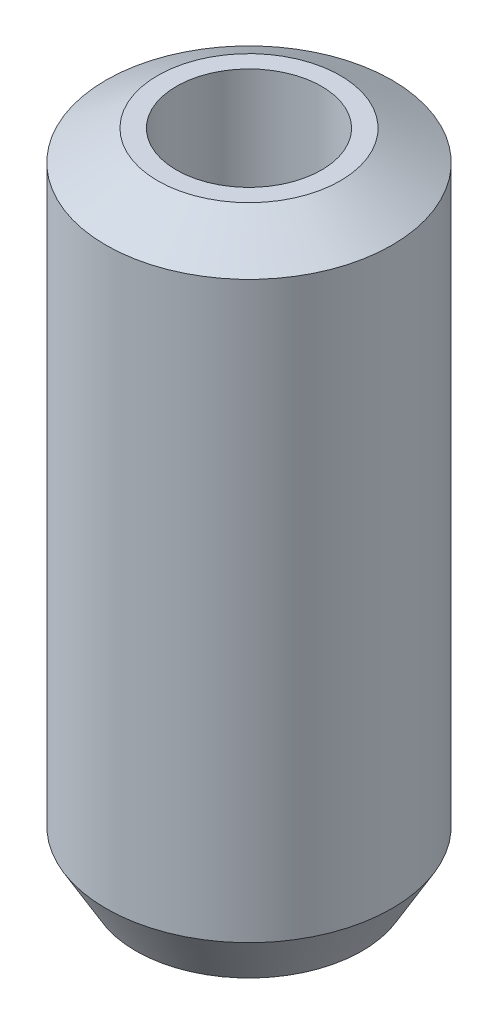
ISO-10303-21;
HEADER;
FILE_DESCRIPTION(('STEP AP214'),'2;1');
FILE_NAME('part.step','',(''),(''),'','','');
FILE_SCHEMA(('AUTOMOTIVE_DESIGN { 1 0 10303 214 1 1 1 1 }'));
ENDSEC;
DATA;
#1=APPLICATION_CONTEXT('core data for automotive mechanical design processes');
#2=APPLICATION_PROTOCOL_DEFINITION('international standard','automotive_design',2000,#1);
#3=PRODUCT_CONTEXT('',#1,'mechanical');
#4=PRODUCT('Part','Part','',(#3));
#5=PRODUCT_RELATED_PRODUCT_CATEGORY('part','',(#4));
#6=PRODUCT_DEFINITION_FORMATION('','',#4);
#7=PRODUCT_DEFINITION_CONTEXT('part definition',#1,'design');
#8=PRODUCT_DEFINITION('design','',#6,#7);
#9=PRODUCT_DEFINITION_SHAPE('','',#8);
#10=(LENGTH_UNIT() NAMED_UNIT(*) SI_UNIT(.MILLI.,.METRE.));
#11=(NAMED_UNIT(*) PLANE_ANGLE_UNIT() SI_UNIT($,.RADIAN.));
#12=(NAMED_UNIT(*) SI_UNIT($,.STERADIAN.) SOLID_ANGLE_UNIT());
#13=UNCERTAINTY_MEASURE_WITH_UNIT(LENGTH_MEASURE(1.E-05),#10,'distance_accuracy_value','');
#14=(GEOMETRIC_REPRESENTATION_CONTEXT(3) GLOBAL_UNCERTAINTY_ASSIGNED_CONTEXT((#13)) GLOBAL_UNIT_ASSIGNED_CONTEXT((#10,
#11,#12)) REPRESENTATION_CONTEXT('',''));
#15=CARTESIAN_POINT('',(0.,0.,0.));
#16=DIRECTION('',(0.,0.,1.));
#17=DIRECTION('',(1.,0.,0.));
#18=AXIS2_PLACEMENT_3D('',#15,#16,#17);
#19=CARTESIAN_POINT('',(0.,34.4065262186894,0.));
#20=DIRECTION('',(0.,-1.,0.));
#21=DIRECTION('',(0.,0.,-1.));
#22=AXIS2_PLACEMENT_3D('',#19,#20,#21);
#23=CYLINDRICAL_SURFACE('',#22,7.5);
#24=CARTESIAN_POINT('',(0.,32.8403993591147,0.));
#25=DIRECTION('',(0.,1.,0.));
#26=DIRECTION('',(0.,0.,1.));
#27=AXIS2_PLACEMENT_3D('',#24,#25,#26);
#28=CIRCLE('',#27,7.5);
#29=CARTESIAN_POINT('',(0.,32.8403993591147,7.5));
#30=VERTEX_POINT('',#29);
#31=EDGE_CURVE('E50',#30,#30,#28,.F.);
#32=ORIENTED_EDGE('',*,*,#31,.T.);
#33=EDGE_LOOP('',(#32));
#34=FACE_BOUND('',#33,.T.);
#35=CARTESIAN_POINT('',(0.,2.71261129188165,0.));
#36=DIRECTION('',(0.,1.,0.));
#37=DIRECTION('',(0.,0.,1.));
#38=AXIS2_PLACEMENT_3D('',#35,#36,#37);
#39=CIRCLE('',#38,7.5);
#40=CARTESIAN_POINT('',(0.,2.71261129188165,7.5));
#41=VERTEX_POINT('',#40);
#42=EDGE_CURVE('E51',#41,#41,#39,.T.);
#43=ORIENTED_EDGE('',*,*,#42,.T.);
#44=EDGE_LOOP('',(#43));
#45=FACE_BOUND('',#44,.T.);
#46=ADVANCED_FACE('F39',(#34,#45),#23,.T.);
#47=CARTESIAN_POINT('',(0.,34.4065262186894,0.));
#48=DIRECTION('',(0.,1.,0.));
#49=DIRECTION('',(0.,0.,1.));
#50=AXIS2_PLACEMENT_3D('',#47,#48,#49);
#51=PLANE('',#50);
#52=CARTESIAN_POINT('',(0.,34.4065262186894,0.));
#53=DIRECTION('',(0.,1.,0.));
#54=DIRECTION('',(0.,0.,1.));
#55=AXIS2_PLACEMENT_3D('',#52,#53,#54);
#56=CIRCLE('',#55,4.78738870811835);
#57=CARTESIAN_POINT('',(0.,34.4065262186894,4.78738870811835));
#58=VERTEX_POINT('',#57);
#59=EDGE_CURVE('E54',#58,#58,#56,.T.);
#60=ORIENTED_EDGE('',*,*,#59,.T.);
#61=EDGE_LOOP('',(#60));
#62=FACE_BOUND('',#61,.T.);
#63=CARTESIAN_POINT('',(0.,34.4065262186894,0.));
#64=DIRECTION('',(0.,1.,0.));
#65=DIRECTION('',(0.,0.,1.));
#66=AXIS2_PLACEMENT_3D('',#63,#64,#65);
#67=CIRCLE('',#66,3.80581369811122);
#68=CARTESIAN_POINT('',(0.,34.4065262186894,3.80581369811122));
#69=VERTEX_POINT('',#68);
#70=EDGE_CURVE('E58',#69,#69,#67,.T.);
#71=ORIENTED_EDGE('',*,*,#70,.F.);
#72=EDGE_LOOP('',(#71));
#73=FACE_BOUND('',#72,.T.);
#74=ADVANCED_FACE('F69',(#62,#73),#51,.T.);
#75=CARTESIAN_POINT('',(0.,0.,0.));
#76=DIRECTION('',(0.,1.,0.));
#77=DIRECTION('',(0.,0.,1.));
#78=AXIS2_PLACEMENT_3D('',#75,#76,#77);
#79=PLANE('',#78);
#80=CARTESIAN_POINT('',(0.,0.,0.));
#81=DIRECTION('',(0.,1.,0.));
#82=DIRECTION('',(0.,0.,1.));
#83=AXIS2_PLACEMENT_3D('',#80,#81,#82);
#84=CIRCLE('',#83,5.9338731404253);
#85=CARTESIAN_POINT('',(0.,0.,5.9338731404253));
#86=VERTEX_POINT('',#85);
#87=EDGE_CURVE('E10',#86,#86,#84,.F.);
#88=ORIENTED_EDGE('',*,*,#87,.T.);
#89=EDGE_LOOP('',(#88));
#90=FACE_BOUND('',#89,.T.);
#91=CARTESIAN_POINT('',(0.,0.,0.));
#92=DIRECTION('',(0.,1.,0.));
#93=DIRECTION('',(0.,0.,1.));
#94=AXIS2_PLACEMENT_3D('',#91,#92,#93);
#95=CIRCLE('',#94,3.80581369811122);
#96=CARTESIAN_POINT('',(0.,0.,3.80581369811122));
#97=VERTEX_POINT('',#96);
#98=EDGE_CURVE('E63',#97,#97,#95,.T.);
#99=ORIENTED_EDGE('',*,*,#98,.T.);
#100=EDGE_LOOP('',(#99));
#101=FACE_BOUND('',#100,.T.);
#102=ADVANCED_FACE('F75',(#90,#101),#79,.F.);
#103=CARTESIAN_POINT('',(0.,34.4065262186894,0.));
#104=DIRECTION('',(0.,-1.,0.));
#105=DIRECTION('',(0.,0.,-1.));
#106=AXIS2_PLACEMENT_3D('',#103,#104,#105);
#107=CYLINDRICAL_SURFACE('',#106,3.80581369811122);
#108=ORIENTED_EDGE('',*,*,#70,.T.);
#109=EDGE_LOOP('',(#108));
#110=FACE_BOUND('',#109,.T.);
#111=ORIENTED_EDGE('',*,*,#98,.F.);
#112=EDGE_LOOP('',(#111));
#113=FACE_BOUND('',#112,.T.);
#114=ADVANCED_FACE('F70',(#110,#113),#107,.F.);
#115=CARTESIAN_POINT('',(0.,34.4065262186894,0.));
#116=DIRECTION('',(0.,-1.,0.));
#117=DIRECTION('',(0.,0.,-1.));
#118=AXIS2_PLACEMENT_3D('',#115,#116,#117);
#119=CONICAL_SURFACE('',#118,4.78738870811835,1.0471975511966);
#120=ORIENTED_EDGE('',*,*,#31,.F.);
#121=EDGE_LOOP('',(#120));
#122=FACE_BOUND('',#121,.T.);
#123=ORIENTED_EDGE('',*,*,#59,.F.);
#124=EDGE_LOOP('',(#123));
#125=FACE_BOUND('',#124,.T.);
#126=ADVANCED_FACE('F81',(#122,#125),#119,.T.);
#127=CARTESIAN_POINT('',(0.,2.71261129188165,0.));
#128=DIRECTION('',(0.,1.,0.));
#129=DIRECTION('',(0.,0.,1.));
#130=AXIS2_PLACEMENT_3D('',#127,#128,#129);
#131=CONICAL_SURFACE('',#130,7.5,0.523598775598302);
#132=ORIENTED_EDGE('',*,*,#87,.F.);
#133=EDGE_LOOP('',(#132));
#134=FACE_BOUND('',#133,.T.);
#135=ORIENTED_EDGE('',*,*,#42,.F.);
#136=EDGE_LOOP('',(#135));
#137=FACE_BOUND('',#136,.T.);
#138=ADVANCED_FACE('F45',(#134,#137),#131,.T.);
#139=CLOSED_SHELL('',(#46,#74,#102,#114,#126,#138));
#140=MANIFOLD_SOLID_BREP('B2',#139);
#141=ADVANCED_BREP_SHAPE_REPRESENTATION('',(#18,#140),#14);
#142=SHAPE_DEFINITION_REPRESENTATION(#9,#141);
ENDSEC;
END-ISO-10303-21;
